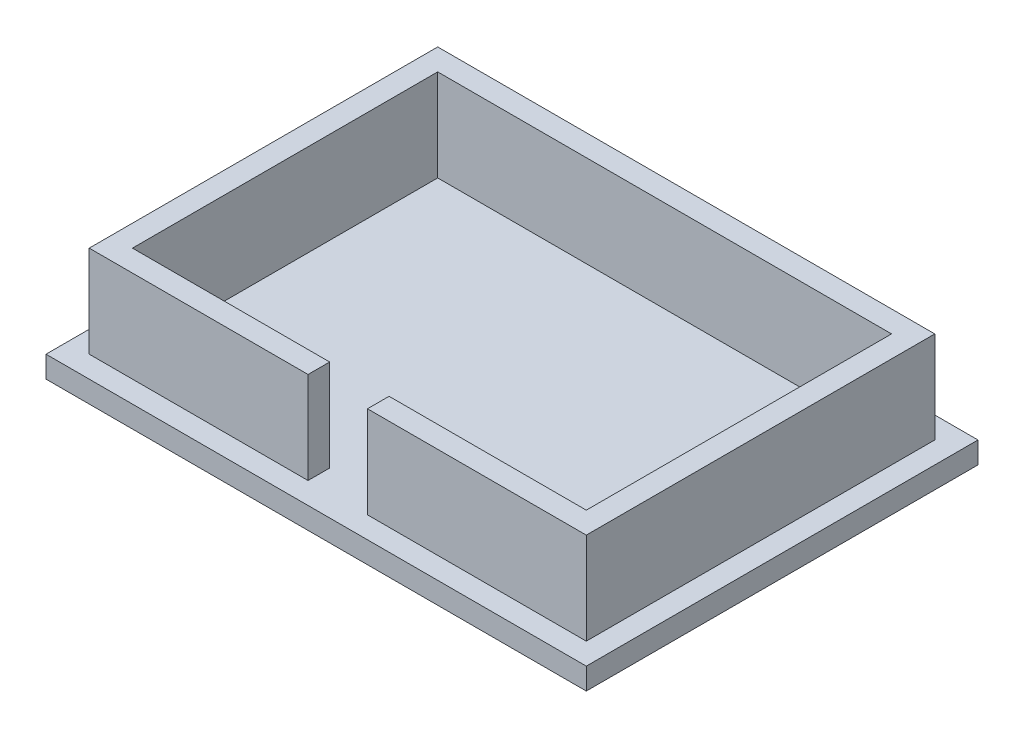
ISO-10303-21;
HEADER;
FILE_DESCRIPTION(('STEP AP214'),'2;1');
FILE_NAME('part.step','',(''),(''),'','','');
FILE_SCHEMA(('AUTOMOTIVE_DESIGN { 1 0 10303 214 1 1 1 1 }'));
ENDSEC;
DATA;
#1=APPLICATION_CONTEXT('core data for automotive mechanical design processes');
#2=APPLICATION_PROTOCOL_DEFINITION('international standard','automotive_design',2000,#1);
#3=PRODUCT_CONTEXT('',#1,'mechanical');
#4=PRODUCT('Part','Part','',(#3));
#5=PRODUCT_RELATED_PRODUCT_CATEGORY('part','',(#4));
#6=PRODUCT_DEFINITION_FORMATION('','',#4);
#7=PRODUCT_DEFINITION_CONTEXT('part definition',#1,'design');
#8=PRODUCT_DEFINITION('design','',#6,#7);
#9=PRODUCT_DEFINITION_SHAPE('','',#8);
#10=(LENGTH_UNIT() NAMED_UNIT(*) SI_UNIT(.MILLI.,.METRE.));
#11=(NAMED_UNIT(*) PLANE_ANGLE_UNIT() SI_UNIT($,.RADIAN.));
#12=(NAMED_UNIT(*) SI_UNIT($,.STERADIAN.) SOLID_ANGLE_UNIT());
#13=UNCERTAINTY_MEASURE_WITH_UNIT(LENGTH_MEASURE(1.E-05),#10,'distance_accuracy_value','');
#14=(GEOMETRIC_REPRESENTATION_CONTEXT(3) GLOBAL_UNCERTAINTY_ASSIGNED_CONTEXT((#13)) GLOBAL_UNIT_ASSIGNED_CONTEXT((#10,
#11,#12)) REPRESENTATION_CONTEXT('',''));
#15=CARTESIAN_POINT('',(0.,0.,0.));
#16=DIRECTION('',(0.,0.,1.));
#17=DIRECTION('',(1.,0.,0.));
#18=AXIS2_PLACEMENT_3D('',#15,#16,#17);
#19=CARTESIAN_POINT('',(0.,21.,31.2127429805615));
#20=DIRECTION('',(0.,0.,-1.));
#21=DIRECTION('',(-1.,0.,0.));
#22=AXIS2_PLACEMENT_3D('',#19,#20,#21);
#23=PLANE('',#22);
#24=DIRECTION('',(-1.,0.,0.));
#25=VECTOR('',#24,1.);
#26=CARTESIAN_POINT('',(0.,4.,31.2127429805615));
#27=LINE('',#26,#25);
#28=CARTESIAN_POINT('',(-2.47084233261336,4.,31.2127429805615));
#29=VERTEX_POINT('',#28);
#30=CARTESIAN_POINT('',(-42.9708423326134,4.,31.2127429805615));
#31=VERTEX_POINT('',#30);
#32=EDGE_CURVE('E157',#29,#31,#27,.T.);
#33=ORIENTED_EDGE('',*,*,#32,.F.);
#34=DIRECTION('',(0.,-1.,0.));
#35=VECTOR('',#34,1.);
#36=CARTESIAN_POINT('',(-2.47084233261336,0.,31.2127429805615));
#37=LINE('',#36,#35);
#38=CARTESIAN_POINT('',(-2.47084233261336,21.,31.2127429805615));
#39=VERTEX_POINT('',#38);
#40=EDGE_CURVE('E166',#39,#29,#37,.T.);
#41=ORIENTED_EDGE('',*,*,#40,.F.);
#42=DIRECTION('',(1.,0.,0.));
#43=VECTOR('',#42,1.);
#44=CARTESIAN_POINT('',(0.,21.,31.2127429805615));
#45=LINE('',#44,#43);
#46=CARTESIAN_POINT('',(-42.9708423326134,21.,31.2127429805615));
#47=VERTEX_POINT('',#46);
#48=EDGE_CURVE('E275',#47,#39,#45,.T.);
#49=ORIENTED_EDGE('',*,*,#48,.F.);
#50=DIRECTION('',(0.,-1.,0.));
#51=VECTOR('',#50,1.);
#52=CARTESIAN_POINT('',(-42.9708423326134,21.,31.2127429805615));
#53=LINE('',#52,#51);
#54=EDGE_CURVE('E175',#47,#31,#53,.T.);
#55=ORIENTED_EDGE('',*,*,#54,.T.);
#56=EDGE_LOOP('',(#33,#41,#49,#55));
#57=FACE_BOUND('',#56,.T.);
#58=ADVANCED_FACE('F41',(#57),#23,.F.);
#59=CARTESIAN_POINT('',(0.,21.,27.2127429805615));
#60=DIRECTION('',(0.,0.,-1.));
#61=DIRECTION('',(-1.,0.,0.));
#62=AXIS2_PLACEMENT_3D('',#59,#60,#61);
#63=PLANE('',#62);
#64=DIRECTION('',(0.,1.,0.));
#65=VECTOR('',#64,1.);
#66=CARTESIAN_POINT('',(-2.47084233261336,21.,27.2127429805615));
#67=LINE('',#66,#65);
#68=CARTESIAN_POINT('',(-2.47084233261336,4.,27.2127429805615));
#69=VERTEX_POINT('',#68);
#70=CARTESIAN_POINT('',(-2.47084233261336,21.,27.2127429805615));
#71=VERTEX_POINT('',#70);
#72=EDGE_CURVE('E334',#69,#71,#67,.T.);
#73=ORIENTED_EDGE('',*,*,#72,.F.);
#74=DIRECTION('',(-1.,0.,0.));
#75=VECTOR('',#74,1.);
#76=CARTESIAN_POINT('',(0.,4.,27.2127429805615));
#77=LINE('',#76,#75);
#78=CARTESIAN_POINT('',(-38.9708423326134,4.00000000000001,27.2127429805615));
#79=VERTEX_POINT('',#78);
#80=EDGE_CURVE('E160',#69,#79,#77,.T.);
#81=ORIENTED_EDGE('',*,*,#80,.T.);
#82=DIRECTION('',(0.,-1.,0.));
#83=VECTOR('',#82,1.);
#84=CARTESIAN_POINT('',(-38.9708423326134,21.,27.2127429805615));
#85=LINE('',#84,#83);
#86=CARTESIAN_POINT('',(-38.9708423326134,21.,27.2127429805615));
#87=VERTEX_POINT('',#86);
#88=EDGE_CURVE('E302',#87,#79,#85,.T.);
#89=ORIENTED_EDGE('',*,*,#88,.F.);
#90=DIRECTION('',(1.,0.,0.));
#91=VECTOR('',#90,1.);
#92=CARTESIAN_POINT('',(0.,21.,27.2127429805615));
#93=LINE('',#92,#91);
#94=EDGE_CURVE('E329',#87,#71,#93,.T.);
#95=ORIENTED_EDGE('',*,*,#94,.T.);
#96=EDGE_LOOP('',(#73,#81,#89,#95));
#97=FACE_BOUND('',#96,.T.);
#98=ADVANCED_FACE('F232',(#97),#63,.T.);
#99=CARTESIAN_POINT('',(0.,4.,0.));
#100=DIRECTION('',(0.,1.,0.));
#101=DIRECTION('',(0.,0.,1.));
#102=AXIS2_PLACEMENT_3D('',#99,#100,#101);
#103=PLANE('',#102);
#104=DIRECTION('',(1.,0.,0.));
#105=VECTOR('',#104,1.);
#106=CARTESIAN_POINT('',(0.,4.,35.2127429805615));
#107=LINE('',#106,#105);
#108=CARTESIAN_POINT('',(-46.9708423326134,4.,35.2127429805615));
#109=VERTEX_POINT('',#108);
#110=CARTESIAN_POINT('',(53.0291576673866,4.,35.2127429805615));
#111=VERTEX_POINT('',#110);
#112=EDGE_CURVE('E187',#109,#111,#107,.T.);
#113=ORIENTED_EDGE('',*,*,#112,.T.);
#114=DIRECTION('',(0.,0.,1.));
#115=VECTOR('',#114,1.);
#116=CARTESIAN_POINT('',(53.0291576673866,4.,0.));
#117=LINE('',#116,#115);
#118=CARTESIAN_POINT('',(53.0291576673866,4.,-37.2872570194385));
#119=VERTEX_POINT('',#118);
#120=EDGE_CURVE('E189',#119,#111,#117,.T.);
#121=ORIENTED_EDGE('',*,*,#120,.F.);
#122=DIRECTION('',(1.,0.,0.));
#123=VECTOR('',#122,1.);
#124=CARTESIAN_POINT('',(0.,4.,-37.2872570194385));
#125=LINE('',#124,#123);
#126=CARTESIAN_POINT('',(-46.9708423326134,4.,-37.2872570194385));
#127=VERTEX_POINT('',#126);
#128=EDGE_CURVE('E193',#127,#119,#125,.T.);
#129=ORIENTED_EDGE('',*,*,#128,.F.);
#130=DIRECTION('',(0.,0.,1.));
#131=VECTOR('',#130,1.);
#132=CARTESIAN_POINT('',(-46.9708423326134,4.,0.));
#133=LINE('',#132,#131);
#134=EDGE_CURVE('E196',#127,#109,#133,.T.);
#135=ORIENTED_EDGE('',*,*,#134,.T.);
#136=EDGE_LOOP('',(#113,#121,#129,#135));
#137=FACE_BOUND('',#136,.T.);
#138=CARTESIAN_POINT('',(49.0291576673866,4.,31.2127429805615));
#139=VERTEX_POINT('',#138);
#140=CARTESIAN_POINT('',(8.52915766738664,4.,31.2127429805615));
#141=VERTEX_POINT('',#140);
#142=EDGE_CURVE('E176',#139,#141,#27,.T.);
#143=ORIENTED_EDGE('',*,*,#142,.T.);
#144=DIRECTION('',(0.,0.,1.));
#145=VECTOR('',#144,1.);
#146=CARTESIAN_POINT('',(8.52915766738664,4.,21.2127429805615));
#147=LINE('',#146,#145);
#148=CARTESIAN_POINT('',(8.52915766738664,4.,27.2127429805615));
#149=VERTEX_POINT('',#148);
#150=EDGE_CURVE('E163',#149,#141,#147,.T.);
#151=ORIENTED_EDGE('',*,*,#150,.F.);
#152=CARTESIAN_POINT('',(45.0291576673866,4.00000000000001,27.2127429805615));
#153=VERTEX_POINT('',#152);
#154=EDGE_CURVE('E314',#153,#149,#77,.T.);
#155=ORIENTED_EDGE('',*,*,#154,.F.);
#156=DIRECTION('',(0.,0.,-1.));
#157=VECTOR('',#156,1.);
#158=CARTESIAN_POINT('',(45.0291576673866,4.,0.));
#159=LINE('',#158,#157);
#160=CARTESIAN_POINT('',(45.0291576673866,4.00000000000001,-29.2872570194385));
#161=VERTEX_POINT('',#160);
#162=EDGE_CURVE('E181',#153,#161,#159,.T.);
#163=ORIENTED_EDGE('',*,*,#162,.T.);
#164=DIRECTION('',(-1.,0.,0.));
#165=VECTOR('',#164,1.);
#166=CARTESIAN_POINT('',(0.,4.,-29.2872570194385));
#167=LINE('',#166,#165);
#168=CARTESIAN_POINT('',(-38.9708423326134,4.,-29.2872570194385));
#169=VERTEX_POINT('',#168);
#170=EDGE_CURVE('E309',#161,#169,#167,.T.);
#171=ORIENTED_EDGE('',*,*,#170,.T.);
#172=DIRECTION('',(0.,0.,-1.));
#173=VECTOR('',#172,1.);
#174=CARTESIAN_POINT('',(-38.9708423326134,4.,0.));
#175=LINE('',#174,#173);
#176=EDGE_CURVE('E312',#79,#169,#175,.T.);
#177=ORIENTED_EDGE('',*,*,#176,.F.);
#178=ORIENTED_EDGE('',*,*,#80,.F.);
#179=DIRECTION('',(0.,0.,1.));
#180=VECTOR('',#179,1.);
#181=CARTESIAN_POINT('',(-2.47084233261336,4.,21.2127429805615));
#182=LINE('',#181,#180);
#183=EDGE_CURVE('E152',#69,#29,#182,.T.);
#184=ORIENTED_EDGE('',*,*,#183,.T.);
#185=ORIENTED_EDGE('',*,*,#32,.T.);
#186=DIRECTION('',(0.,0.,-1.));
#187=VECTOR('',#186,1.);
#188=CARTESIAN_POINT('',(-42.9708423326134,4.,0.));
#189=LINE('',#188,#187);
#190=CARTESIAN_POINT('',(-42.9708423326134,4.00000000000001,-33.2872570194384));
#191=VERTEX_POINT('',#190);
#192=EDGE_CURVE('E179',#31,#191,#189,.T.);
#193=ORIENTED_EDGE('',*,*,#192,.T.);
#194=DIRECTION('',(-1.,0.,0.));
#195=VECTOR('',#194,1.);
#196=CARTESIAN_POINT('',(0.,4.,-33.2872570194384));
#197=LINE('',#196,#195);
#198=CARTESIAN_POINT('',(49.0291576673866,4.,-33.2872570194384));
#199=VERTEX_POINT('',#198);
#200=EDGE_CURVE('E298',#199,#191,#197,.T.);
#201=ORIENTED_EDGE('',*,*,#200,.F.);
#202=DIRECTION('',(0.,0.,-1.));
#203=VECTOR('',#202,1.);
#204=CARTESIAN_POINT('',(49.0291576673866,4.,0.));
#205=LINE('',#204,#203);
#206=EDGE_CURVE('E177',#139,#199,#205,.T.);
#207=ORIENTED_EDGE('',*,*,#206,.F.);
#208=EDGE_LOOP('',(#143,#151,#155,#163,#171,#177,#178,#184,#185,#193,#201,#207));
#209=FACE_BOUND('',#208,.T.);
#210=ADVANCED_FACE('F155',(#137,#209),#103,.T.);
#211=CARTESIAN_POINT('',(0.,4.,35.2127429805615));
#212=DIRECTION('',(0.,0.,-1.));
#213=DIRECTION('',(-1.,0.,0.));
#214=AXIS2_PLACEMENT_3D('',#211,#212,#213);
#215=PLANE('',#214);
#216=DIRECTION('',(1.,0.,0.));
#217=VECTOR('',#216,1.);
#218=CARTESIAN_POINT('',(0.,0.,35.2127429805615));
#219=LINE('',#218,#217);
#220=CARTESIAN_POINT('',(-46.9708423326134,0.,35.2127429805615));
#221=VERTEX_POINT('',#220);
#222=CARTESIAN_POINT('',(53.0291576673866,0.,35.2127429805615));
#223=VERTEX_POINT('',#222);
#224=EDGE_CURVE('E186',#221,#223,#219,.T.);
#225=ORIENTED_EDGE('',*,*,#224,.T.);
#226=DIRECTION('',(0.,-1.,0.));
#227=VECTOR('',#226,1.);
#228=CARTESIAN_POINT('',(53.0291576673866,4.,35.2127429805615));
#229=LINE('',#228,#227);
#230=EDGE_CURVE('E11',#111,#223,#229,.T.);
#231=ORIENTED_EDGE('',*,*,#230,.F.);
#232=ORIENTED_EDGE('',*,*,#112,.F.);
#233=DIRECTION('',(0.,-1.,0.));
#234=VECTOR('',#233,1.);
#235=CARTESIAN_POINT('',(-46.9708423326134,4.,35.2127429805615));
#236=LINE('',#235,#234);
#237=EDGE_CURVE('E198',#109,#221,#236,.T.);
#238=ORIENTED_EDGE('',*,*,#237,.T.);
#239=EDGE_LOOP('',(#225,#231,#232,#238));
#240=FACE_BOUND('',#239,.T.);
#241=ADVANCED_FACE('F43',(#240),#215,.F.);
#242=CARTESIAN_POINT('',(53.0291576673866,4.,0.));
#243=DIRECTION('',(1.,0.,0.));
#244=DIRECTION('',(0.,0.,-1.));
#245=AXIS2_PLACEMENT_3D('',#242,#243,#244);
#246=PLANE('',#245);
#247=DIRECTION('',(0.,0.,1.));
#248=VECTOR('',#247,1.);
#249=CARTESIAN_POINT('',(53.0291576673866,0.,0.));
#250=LINE('',#249,#248);
#251=CARTESIAN_POINT('',(53.0291576673866,0.,-37.2872570194385));
#252=VERTEX_POINT('',#251);
#253=EDGE_CURVE('E201',#252,#223,#250,.T.);
#254=ORIENTED_EDGE('',*,*,#253,.F.);
#255=DIRECTION('',(0.,-1.,0.));
#256=VECTOR('',#255,1.);
#257=CARTESIAN_POINT('',(53.0291576673866,4.,-37.2872570194385));
#258=LINE('',#257,#256);
#259=EDGE_CURVE('E49',#119,#252,#258,.T.);
#260=ORIENTED_EDGE('',*,*,#259,.F.);
#261=ORIENTED_EDGE('',*,*,#120,.T.);
#262=ORIENTED_EDGE('',*,*,#230,.T.);
#263=EDGE_LOOP('',(#254,#260,#261,#262));
#264=FACE_BOUND('',#263,.T.);
#265=ADVANCED_FACE('F218',(#264),#246,.T.);
#266=CARTESIAN_POINT('',(0.,4.,-37.2872570194385));
#267=DIRECTION('',(0.,0.,-1.));
#268=DIRECTION('',(-1.,0.,0.));
#269=AXIS2_PLACEMENT_3D('',#266,#267,#268);
#270=PLANE('',#269);
#271=DIRECTION('',(1.,0.,0.));
#272=VECTOR('',#271,1.);
#273=CARTESIAN_POINT('',(0.,0.,-37.2872570194385));
#274=LINE('',#273,#272);
#275=CARTESIAN_POINT('',(-46.9708423326134,0.,-37.2872570194385));
#276=VERTEX_POINT('',#275);
#277=EDGE_CURVE('E204',#276,#252,#274,.T.);
#278=ORIENTED_EDGE('',*,*,#277,.F.);
#279=DIRECTION('',(0.,-1.,0.));
#280=VECTOR('',#279,1.);
#281=CARTESIAN_POINT('',(-46.9708423326134,4.,-37.2872570194385));
#282=LINE('',#281,#280);
#283=EDGE_CURVE('E210',#127,#276,#282,.T.);
#284=ORIENTED_EDGE('',*,*,#283,.F.);
#285=ORIENTED_EDGE('',*,*,#128,.T.);
#286=ORIENTED_EDGE('',*,*,#259,.T.);
#287=EDGE_LOOP('',(#278,#284,#285,#286));
#288=FACE_BOUND('',#287,.T.);
#289=ADVANCED_FACE('F214',(#288),#270,.T.);
#290=CARTESIAN_POINT('',(-46.9708423326134,4.,0.));
#291=DIRECTION('',(1.,0.,0.));
#292=DIRECTION('',(0.,0.,-1.));
#293=AXIS2_PLACEMENT_3D('',#290,#291,#292);
#294=PLANE('',#293);
#295=DIRECTION('',(0.,0.,1.));
#296=VECTOR('',#295,1.);
#297=CARTESIAN_POINT('',(-46.9708423326134,0.,0.));
#298=LINE('',#297,#296);
#299=EDGE_CURVE('E190',#276,#221,#298,.T.);
#300=ORIENTED_EDGE('',*,*,#299,.T.);
#301=ORIENTED_EDGE('',*,*,#237,.F.);
#302=ORIENTED_EDGE('',*,*,#134,.F.);
#303=ORIENTED_EDGE('',*,*,#283,.T.);
#304=EDGE_LOOP('',(#300,#301,#302,#303));
#305=FACE_BOUND('',#304,.T.);
#306=ADVANCED_FACE('F226',(#305),#294,.F.);
#307=CARTESIAN_POINT('',(0.,0.,0.));
#308=DIRECTION('',(0.,1.,0.));
#309=DIRECTION('',(0.,0.,1.));
#310=AXIS2_PLACEMENT_3D('',#307,#308,#309);
#311=PLANE('',#310);
#312=ORIENTED_EDGE('',*,*,#224,.F.);
#313=ORIENTED_EDGE('',*,*,#299,.F.);
#314=ORIENTED_EDGE('',*,*,#277,.T.);
#315=ORIENTED_EDGE('',*,*,#253,.T.);
#316=EDGE_LOOP('',(#312,#313,#314,#315));
#317=FACE_BOUND('',#316,.T.);
#318=ADVANCED_FACE('F223',(#317),#311,.F.);
#319=CARTESIAN_POINT('',(-42.9708423326134,21.,0.));
#320=DIRECTION('',(1.,0.,0.));
#321=DIRECTION('',(0.,0.,-1.));
#322=AXIS2_PLACEMENT_3D('',#319,#320,#321);
#323=PLANE('',#322);
#324=ORIENTED_EDGE('',*,*,#192,.F.);
#325=ORIENTED_EDGE('',*,*,#54,.F.);
#326=DIRECTION('',(0.,0.,1.));
#327=VECTOR('',#326,1.);
#328=CARTESIAN_POINT('',(-42.9708423326134,21.,0.));
#329=LINE('',#328,#327);
#330=CARTESIAN_POINT('',(-42.9708423326134,21.,-33.2872570194384));
#331=VERTEX_POINT('',#330);
#332=EDGE_CURVE('E276',#331,#47,#329,.T.);
#333=ORIENTED_EDGE('',*,*,#332,.F.);
#334=DIRECTION('',(0.,-1.,0.));
#335=VECTOR('',#334,1.);
#336=CARTESIAN_POINT('',(-42.9708423326134,21.,-33.2872570194384));
#337=LINE('',#336,#335);
#338=EDGE_CURVE('E289',#331,#191,#337,.T.);
#339=ORIENTED_EDGE('',*,*,#338,.T.);
#340=EDGE_LOOP('',(#324,#325,#333,#339));
#341=FACE_BOUND('',#340,.T.);
#342=ADVANCED_FACE('F255',(#341),#323,.F.);
#343=CARTESIAN_POINT('',(8.52915766738664,21.,31.2127429805615));
#344=VERTEX_POINT('',#343);
#345=CARTESIAN_POINT('',(49.0291576673866,21.,31.2127429805615));
#346=VERTEX_POINT('',#345);
#347=EDGE_CURVE('E268',#344,#346,#45,.T.);
#348=ORIENTED_EDGE('',*,*,#347,.F.);
#349=DIRECTION('',(0.,1.,0.));
#350=VECTOR('',#349,1.);
#351=CARTESIAN_POINT('',(8.52915766738664,0.,31.2127429805615));
#352=LINE('',#351,#350);
#353=EDGE_CURVE('E56',#141,#344,#352,.T.);
#354=ORIENTED_EDGE('',*,*,#353,.F.);
#355=ORIENTED_EDGE('',*,*,#142,.F.);
#356=DIRECTION('',(0.,-1.,0.));
#357=VECTOR('',#356,1.);
#358=CARTESIAN_POINT('',(49.0291576673866,21.,31.2127429805615));
#359=LINE('',#358,#357);
#360=EDGE_CURVE('E271',#346,#139,#359,.T.);
#361=ORIENTED_EDGE('',*,*,#360,.F.);
#362=EDGE_LOOP('',(#348,#354,#355,#361));
#363=FACE_BOUND('',#362,.T.);
#364=ADVANCED_FACE('F247',(#363),#23,.F.);
#365=CARTESIAN_POINT('',(49.0291576673866,21.,0.));
#366=DIRECTION('',(1.,0.,0.));
#367=DIRECTION('',(0.,0.,-1.));
#368=AXIS2_PLACEMENT_3D('',#365,#366,#367);
#369=PLANE('',#368);
#370=ORIENTED_EDGE('',*,*,#360,.T.);
#371=ORIENTED_EDGE('',*,*,#206,.T.);
#372=DIRECTION('',(0.,-1.,0.));
#373=VECTOR('',#372,1.);
#374=CARTESIAN_POINT('',(49.0291576673866,21.,-33.2872570194384));
#375=LINE('',#374,#373);
#376=CARTESIAN_POINT('',(49.0291576673866,21.,-33.2872570194384));
#377=VERTEX_POINT('',#376);
#378=EDGE_CURVE('E292',#377,#199,#375,.T.);
#379=ORIENTED_EDGE('',*,*,#378,.F.);
#380=DIRECTION('',(0.,0.,1.));
#381=VECTOR('',#380,1.);
#382=CARTESIAN_POINT('',(49.0291576673866,21.,0.));
#383=LINE('',#382,#381);
#384=EDGE_CURVE('E278',#377,#346,#383,.T.);
#385=ORIENTED_EDGE('',*,*,#384,.T.);
#386=EDGE_LOOP('',(#370,#371,#379,#385));
#387=FACE_BOUND('',#386,.T.);
#388=ADVANCED_FACE('F254',(#387),#369,.T.);
#389=CARTESIAN_POINT('',(45.0291576673866,21.,0.));
#390=DIRECTION('',(1.,0.,0.));
#391=DIRECTION('',(0.,0.,-1.));
#392=AXIS2_PLACEMENT_3D('',#389,#390,#391);
#393=PLANE('',#392);
#394=ORIENTED_EDGE('',*,*,#162,.F.);
#395=DIRECTION('',(0.,-1.,0.));
#396=VECTOR('',#395,1.);
#397=CARTESIAN_POINT('',(45.0291576673866,21.,27.2127429805615));
#398=LINE('',#397,#396);
#399=CARTESIAN_POINT('',(45.0291576673866,21.,27.2127429805615));
#400=VERTEX_POINT('',#399);
#401=EDGE_CURVE('E293',#400,#153,#398,.T.);
#402=ORIENTED_EDGE('',*,*,#401,.F.);
#403=DIRECTION('',(0.,0.,1.));
#404=VECTOR('',#403,1.);
#405=CARTESIAN_POINT('',(45.0291576673866,21.,0.));
#406=LINE('',#405,#404);
#407=CARTESIAN_POINT('',(45.0291576673866,21.,-29.2872570194385));
#408=VERTEX_POINT('',#407);
#409=EDGE_CURVE('E330',#408,#400,#406,.T.);
#410=ORIENTED_EDGE('',*,*,#409,.F.);
#411=DIRECTION('',(0.,-1.,0.));
#412=VECTOR('',#411,1.);
#413=CARTESIAN_POINT('',(45.0291576673866,21.,-29.2872570194385));
#414=LINE('',#413,#412);
#415=EDGE_CURVE('E288',#408,#161,#414,.T.);
#416=ORIENTED_EDGE('',*,*,#415,.T.);
#417=EDGE_LOOP('',(#394,#402,#410,#416));
#418=FACE_BOUND('',#417,.T.);
#419=ADVANCED_FACE('F262',(#418),#393,.F.);
#420=DIRECTION('',(0.,-1.,0.));
#421=VECTOR('',#420,1.);
#422=CARTESIAN_POINT('',(8.52915766738664,21.,27.2127429805615));
#423=LINE('',#422,#421);
#424=CARTESIAN_POINT('',(8.52915766738664,21.,27.2127429805615));
#425=VERTEX_POINT('',#424);
#426=EDGE_CURVE('E328',#425,#149,#423,.T.);
#427=ORIENTED_EDGE('',*,*,#426,.F.);
#428=EDGE_CURVE('E326',#425,#400,#93,.T.);
#429=ORIENTED_EDGE('',*,*,#428,.T.);
#430=ORIENTED_EDGE('',*,*,#401,.T.);
#431=ORIENTED_EDGE('',*,*,#154,.T.);
#432=EDGE_LOOP('',(#427,#429,#430,#431));
#433=FACE_BOUND('',#432,.T.);
#434=ADVANCED_FACE('F242',(#433),#63,.T.);
#435=CARTESIAN_POINT('',(-38.9708423326134,21.,0.));
#436=DIRECTION('',(1.,0.,0.));
#437=DIRECTION('',(0.,0.,-1.));
#438=AXIS2_PLACEMENT_3D('',#435,#436,#437);
#439=PLANE('',#438);
#440=ORIENTED_EDGE('',*,*,#88,.T.);
#441=ORIENTED_EDGE('',*,*,#176,.T.);
#442=DIRECTION('',(0.,-1.,0.));
#443=VECTOR('',#442,1.);
#444=CARTESIAN_POINT('',(-38.9708423326134,21.,-29.2872570194385));
#445=LINE('',#444,#443);
#446=CARTESIAN_POINT('',(-38.9708423326134,21.,-29.2872570194385));
#447=VERTEX_POINT('',#446);
#448=EDGE_CURVE('E64',#447,#169,#445,.T.);
#449=ORIENTED_EDGE('',*,*,#448,.F.);
#450=DIRECTION('',(0.,0.,1.));
#451=VECTOR('',#450,1.);
#452=CARTESIAN_POINT('',(-38.9708423326134,21.,0.));
#453=LINE('',#452,#451);
#454=EDGE_CURVE('E340',#447,#87,#453,.T.);
#455=ORIENTED_EDGE('',*,*,#454,.T.);
#456=EDGE_LOOP('',(#440,#441,#449,#455));
#457=FACE_BOUND('',#456,.T.);
#458=ADVANCED_FACE('F343',(#457),#439,.T.);
#459=CARTESIAN_POINT('',(0.,21.,-29.2872570194385));
#460=DIRECTION('',(0.,0.,-1.));
#461=DIRECTION('',(-1.,0.,0.));
#462=AXIS2_PLACEMENT_3D('',#459,#460,#461);
#463=PLANE('',#462);
#464=ORIENTED_EDGE('',*,*,#170,.F.);
#465=ORIENTED_EDGE('',*,*,#415,.F.);
#466=DIRECTION('',(1.,0.,0.));
#467=VECTOR('',#466,1.);
#468=CARTESIAN_POINT('',(0.,21.,-29.2872570194385));
#469=LINE('',#468,#467);
#470=EDGE_CURVE('E280',#447,#408,#469,.T.);
#471=ORIENTED_EDGE('',*,*,#470,.F.);
#472=ORIENTED_EDGE('',*,*,#448,.T.);
#473=EDGE_LOOP('',(#464,#465,#471,#472));
#474=FACE_BOUND('',#473,.T.);
#475=ADVANCED_FACE('F356',(#474),#463,.F.);
#476=CARTESIAN_POINT('',(0.,21.,-33.2872570194384));
#477=DIRECTION('',(0.,0.,-1.));
#478=DIRECTION('',(-1.,0.,0.));
#479=AXIS2_PLACEMENT_3D('',#476,#477,#478);
#480=PLANE('',#479);
#481=ORIENTED_EDGE('',*,*,#378,.T.);
#482=ORIENTED_EDGE('',*,*,#200,.T.);
#483=ORIENTED_EDGE('',*,*,#338,.F.);
#484=DIRECTION('',(1.,0.,0.));
#485=VECTOR('',#484,1.);
#486=CARTESIAN_POINT('',(0.,21.,-33.2872570194384));
#487=LINE('',#486,#485);
#488=EDGE_CURVE('E285',#331,#377,#487,.T.);
#489=ORIENTED_EDGE('',*,*,#488,.T.);
#490=EDGE_LOOP('',(#481,#482,#483,#489));
#491=FACE_BOUND('',#490,.T.);
#492=ADVANCED_FACE('F353',(#491),#480,.T.);
#493=CARTESIAN_POINT('',(0.,21.,0.));
#494=DIRECTION('',(0.,1.,0.));
#495=DIRECTION('',(0.,0.,1.));
#496=AXIS2_PLACEMENT_3D('',#493,#494,#495);
#497=PLANE('',#496);
#498=DIRECTION('',(0.,0.,1.));
#499=VECTOR('',#498,1.);
#500=CARTESIAN_POINT('',(-2.47084233261336,21.,21.2127429805615));
#501=LINE('',#500,#499);
#502=EDGE_CURVE('E169',#71,#39,#501,.T.);
#503=ORIENTED_EDGE('',*,*,#502,.F.);
#504=ORIENTED_EDGE('',*,*,#94,.F.);
#505=ORIENTED_EDGE('',*,*,#454,.F.);
#506=ORIENTED_EDGE('',*,*,#470,.T.);
#507=ORIENTED_EDGE('',*,*,#409,.T.);
#508=ORIENTED_EDGE('',*,*,#428,.F.);
#509=DIRECTION('',(0.,0.,1.));
#510=VECTOR('',#509,1.);
#511=CARTESIAN_POINT('',(8.52915766738664,21.,21.2127429805615));
#512=LINE('',#511,#510);
#513=EDGE_CURVE('E345',#425,#344,#512,.T.);
#514=ORIENTED_EDGE('',*,*,#513,.T.);
#515=ORIENTED_EDGE('',*,*,#347,.T.);
#516=ORIENTED_EDGE('',*,*,#384,.F.);
#517=ORIENTED_EDGE('',*,*,#488,.F.);
#518=ORIENTED_EDGE('',*,*,#332,.T.);
#519=ORIENTED_EDGE('',*,*,#48,.T.);
#520=EDGE_LOOP('',(#503,#504,#505,#506,#507,#508,#514,#515,#516,#517,#518,#519));
#521=FACE_BOUND('',#520,.T.);
#522=ADVANCED_FACE('F332',(#521),#497,.T.);
#523=CARTESIAN_POINT('',(-2.47084233261336,0.,21.2127429805615));
#524=DIRECTION('',(-1.,0.,0.));
#525=DIRECTION('',(0.,-1.,0.));
#526=AXIS2_PLACEMENT_3D('',#523,#524,#525);
#527=PLANE('',#526);
#528=ORIENTED_EDGE('',*,*,#72,.T.);
#529=ORIENTED_EDGE('',*,*,#502,.T.);
#530=ORIENTED_EDGE('',*,*,#40,.T.);
#531=ORIENTED_EDGE('',*,*,#183,.F.);
#532=EDGE_LOOP('',(#528,#529,#530,#531));
#533=FACE_BOUND('',#532,.T.);
#534=ADVANCED_FACE('F167',(#533),#527,.F.);
#535=CARTESIAN_POINT('',(8.52915766738664,0.,21.2127429805615));
#536=DIRECTION('',(1.,0.,0.));
#537=DIRECTION('',(0.,0.,-1.));
#538=AXIS2_PLACEMENT_3D('',#535,#536,#537);
#539=PLANE('',#538);
#540=ORIENTED_EDGE('',*,*,#426,.T.);
#541=ORIENTED_EDGE('',*,*,#150,.T.);
#542=ORIENTED_EDGE('',*,*,#353,.T.);
#543=ORIENTED_EDGE('',*,*,#513,.F.);
#544=EDGE_LOOP('',(#540,#541,#542,#543));
#545=FACE_BOUND('',#544,.T.);
#546=ADVANCED_FACE('F350',(#545),#539,.F.);
#547=CLOSED_SHELL('',(#58,#98,#210,#241,#265,#289,#306,#318,#342,#364,#388,#419,#434,#458,#475,
#492,#522,#534,#546));
#548=MANIFOLD_SOLID_BREP('B2',#547);
#549=ADVANCED_BREP_SHAPE_REPRESENTATION('',(#18,#548),#14);
#550=SHAPE_DEFINITION_REPRESENTATION(#9,#549);
ENDSEC;
END-ISO-10303-21;
